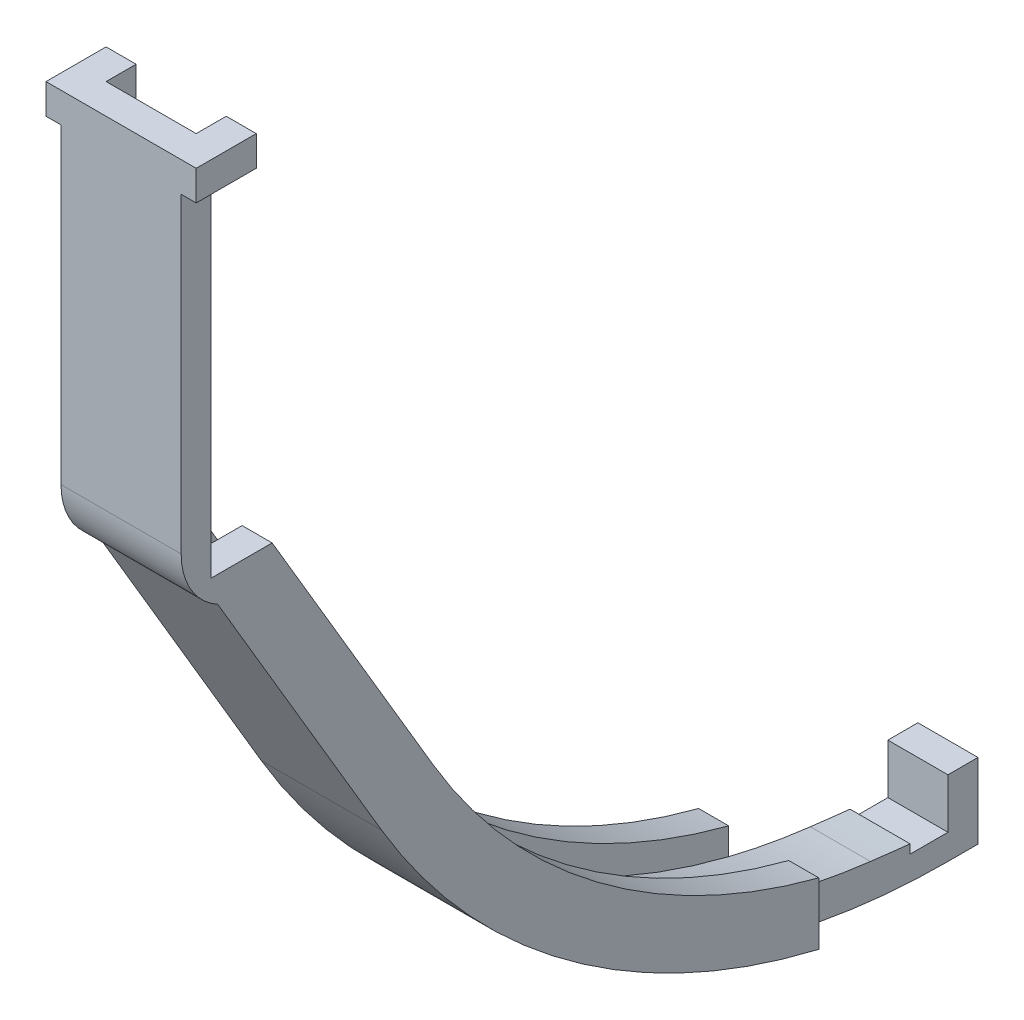
ISO-10303-21;
HEADER;
FILE_DESCRIPTION(('STEP AP214'),'2;1');
FILE_NAME('part.step','',(''),(''),'','','');
FILE_SCHEMA(('AUTOMOTIVE_DESIGN { 1 0 10303 214 1 1 1 1 }'));
ENDSEC;
DATA;
#1=APPLICATION_CONTEXT('core data for automotive mechanical design processes');
#2=APPLICATION_PROTOCOL_DEFINITION('international standard','automotive_design',2000,#1);
#3=PRODUCT_CONTEXT('',#1,'mechanical');
#4=PRODUCT('Part','Part','',(#3));
#5=PRODUCT_RELATED_PRODUCT_CATEGORY('part','',(#4));
#6=PRODUCT_DEFINITION_FORMATION('','',#4);
#7=PRODUCT_DEFINITION_CONTEXT('part definition',#1,'design');
#8=PRODUCT_DEFINITION('design','',#6,#7);
#9=PRODUCT_DEFINITION_SHAPE('','',#8);
#10=(LENGTH_UNIT() NAMED_UNIT(*) SI_UNIT(.MILLI.,.METRE.));
#11=(NAMED_UNIT(*) PLANE_ANGLE_UNIT() SI_UNIT($,.RADIAN.));
#12=(NAMED_UNIT(*) SI_UNIT($,.STERADIAN.) SOLID_ANGLE_UNIT());
#13=UNCERTAINTY_MEASURE_WITH_UNIT(LENGTH_MEASURE(1.E-05),#10,'distance_accuracy_value','');
#14=(GEOMETRIC_REPRESENTATION_CONTEXT(3) GLOBAL_UNCERTAINTY_ASSIGNED_CONTEXT((#13)) GLOBAL_UNIT_ASSIGNED_CONTEXT((#10,
#11,#12)) REPRESENTATION_CONTEXT('',''));
#15=CARTESIAN_POINT('',(0.,0.,0.));
#16=DIRECTION('',(0.,0.,1.));
#17=DIRECTION('',(1.,0.,0.));
#18=AXIS2_PLACEMENT_3D('',#15,#16,#17);
#19=CARTESIAN_POINT('',(-6.35,0.,0.));
#20=DIRECTION('',(1.,0.,0.));
#21=DIRECTION('',(0.,0.,-1.));
#22=AXIS2_PLACEMENT_3D('',#19,#20,#21);
#23=PLANE('',#22);
#24=DIRECTION('',(0.,1.,0.));
#25=VECTOR('',#24,1.);
#26=CARTESIAN_POINT('',(-6.35,-70.6177629374041,-57.785));
#27=LINE('',#26,#25);
#28=CARTESIAN_POINT('',(-6.35,-105.990711991471,-57.785));
#29=VERTEX_POINT('',#28);
#30=CARTESIAN_POINT('',(-6.35,-99.4487584920311,-57.785));
#31=VERTEX_POINT('',#30);
#32=EDGE_CURVE('E352',#29,#31,#27,.T.);
#33=ORIENTED_EDGE('',*,*,#32,.F.);
#34=CARTESIAN_POINT('',(-6.35,-34.7296686216215,-74.61));
#35=DIRECTION('',(1.,0.,0.));
#36=DIRECTION('',(0.,0.,-1.));
#37=AXIS2_PLACEMENT_3D('',#34,#35,#36);
#38=CIRCLE('',#37,73.2203313783785);
#39=CARTESIAN_POINT('',(-6.35,-71.962270862946,-11.5627934203356));
#40=VERTEX_POINT('',#39);
#41=EDGE_CURVE('E362',#40,#29,#38,.T.);
#42=ORIENTED_EDGE('',*,*,#41,.F.);
#43=DIRECTION('',(0.,0.861061475587392,0.508500870460675));
#44=VECTOR('',#43,1.);
#45=CARTESIAN_POINT('',(-6.35,-13.5447350029508,22.9357513144768));
#46=LINE('',#45,#44);
#47=CARTESIAN_POINT('',(-6.35,-42.6344563738377,5.75678203302841));
#48=VERTEX_POINT('',#47);
#49=EDGE_CURVE('E380',#40,#48,#46,.T.);
#50=ORIENTED_EDGE('',*,*,#49,.T.);
#51=CARTESIAN_POINT('',(-6.35,-36.1011936903704,2.15439927751977));
#52=DIRECTION('',(-1.,0.,0.));
#53=DIRECTION('',(0.,0.,-1.));
#54=AXIS2_PLACEMENT_3D('',#51,#52,#53);
#55=CIRCLE('',#54,7.46060874248023);
#56=CARTESIAN_POINT('',(-6.35,-36.1011936903704,9.61500801999999));
#57=VERTEX_POINT('',#56);
#58=EDGE_CURVE('E483',#48,#57,#55,.T.);
#59=ORIENTED_EDGE('',*,*,#58,.T.);
#60=DIRECTION('',(0.,1.,0.));
#61=VECTOR('',#60,1.);
#62=CARTESIAN_POINT('',(-6.35,0.,9.61500802));
#63=LINE('',#62,#61);
#64=CARTESIAN_POINT('',(-6.34999999999999,-3.17499999999999,9.61500801999999));
#65=VERTEX_POINT('',#64);
#66=EDGE_CURVE('E484',#57,#65,#63,.T.);
#67=ORIENTED_EDGE('',*,*,#66,.T.);
#68=DIRECTION('',(0.,0.,1.));
#69=VECTOR('',#68,1.);
#70=CARTESIAN_POINT('',(-6.35,-3.17499999999999,0.));
#71=LINE('',#70,#69);
#72=CARTESIAN_POINT('',(-6.34999999999999,-3.17499999999999,6.44000802));
#73=VERTEX_POINT('',#72);
#74=EDGE_CURVE('E479',#73,#65,#71,.T.);
#75=ORIENTED_EDGE('',*,*,#74,.F.);
#76=DIRECTION('',(0.,-1.,0.));
#77=VECTOR('',#76,1.);
#78=CARTESIAN_POINT('',(-6.35,-39.8949197300881,6.44000802));
#79=LINE('',#78,#77);
#80=CARTESIAN_POINT('',(-6.35,-39.8949197300881,6.44000802));
#81=VERTEX_POINT('',#80);
#82=EDGE_CURVE('E481',#73,#81,#79,.T.);
#83=ORIENTED_EDGE('',*,*,#82,.T.);
#84=DIRECTION('',(0.,0.,-1.));
#85=VECTOR('',#84,1.);
#86=CARTESIAN_POINT('',(-6.35,-39.8949197300881,-6.4400080213912));
#87=LINE('',#86,#85);
#88=CARTESIAN_POINT('',(-6.35,-39.8949197300881,0.));
#89=VERTEX_POINT('',#88);
#90=EDGE_CURVE('E332',#81,#89,#87,.T.);
#91=ORIENTED_EDGE('',*,*,#90,.T.);
#92=DIRECTION('',(0.,0.861061475587392,0.508500870460675));
#93=VECTOR('',#92,1.);
#94=CARTESIAN_POINT('',(-6.35,-10.3157544755255,17.4680109444969));
#95=LINE('',#94,#93);
#96=CARTESIAN_POINT('',(-6.35,-68.7332903355207,-17.0305337903155));
#97=VERTEX_POINT('',#96);
#98=EDGE_CURVE('E381',#97,#89,#95,.T.);
#99=ORIENTED_EDGE('',*,*,#98,.F.);
#100=CARTESIAN_POINT('',(-6.35,-34.7296686216215,-74.61));
#101=DIRECTION('',(1.,0.,0.));
#102=DIRECTION('',(0.,0.,-1.));
#103=AXIS2_PLACEMENT_3D('',#100,#101,#102);
#104=CIRCLE('',#103,66.8703313783785);
#105=EDGE_CURVE('E365',#97,#31,#104,.T.);
#106=ORIENTED_EDGE('',*,*,#105,.T.);
#107=EDGE_LOOP('',(#33,#42,#50,#59,#67,#75,#83,#91,#99,#106));
#108=FACE_BOUND('',#107,.T.);
#109=ADVANCED_FACE('F77',(#108),#23,.F.);
#110=CARTESIAN_POINT('',(6.35,-34.7296686216215,-74.61));
#111=DIRECTION('',(-1.,0.,0.));
#112=DIRECTION('',(0.,0.,1.));
#113=AXIS2_PLACEMENT_3D('',#110,#111,#112);
#114=CYLINDRICAL_SURFACE('',#113,66.8703313783785);
#115=CARTESIAN_POINT('',(6.35,-34.7296686216215,-74.61));
#116=DIRECTION('',(1.,0.,0.));
#117=DIRECTION('',(0.,0.,-1.));
#118=AXIS2_PLACEMENT_3D('',#115,#116,#117);
#119=CIRCLE('',#118,66.8703313783785);
#120=CARTESIAN_POINT('',(6.35,-68.7332903355207,-17.0305337903155));
#121=VERTEX_POINT('',#120);
#122=CARTESIAN_POINT('',(6.35,-99.4487584920311,-57.785));
#123=VERTEX_POINT('',#122);
#124=EDGE_CURVE('E372',#121,#123,#119,.T.);
#125=ORIENTED_EDGE('',*,*,#124,.T.);
#126=DIRECTION('',(-1.,0.,0.));
#127=VECTOR('',#126,1.);
#128=CARTESIAN_POINT('',(6.35,-99.4487584920311,-57.785));
#129=LINE('',#128,#127);
#130=CARTESIAN_POINT('',(3.175,-99.4487584920311,-57.785));
#131=VERTEX_POINT('',#130);
#132=EDGE_CURVE('E406',#123,#131,#129,.T.);
#133=ORIENTED_EDGE('',*,*,#132,.T.);
#134=CARTESIAN_POINT('',(3.175,-34.7296686216215,-74.61));
#135=DIRECTION('',(-1.,0.,0.));
#136=DIRECTION('',(0.,0.,1.));
#137=AXIS2_PLACEMENT_3D('',#134,#135,#136);
#138=CIRCLE('',#137,66.8703313783785);
#139=CARTESIAN_POINT('',(3.175,-68.7332903355207,-17.0305337903155));
#140=VERTEX_POINT('',#139);
#141=EDGE_CURVE('E530',#131,#140,#138,.T.);
#142=ORIENTED_EDGE('',*,*,#141,.T.);
#143=DIRECTION('',(-1.,0.,0.));
#144=VECTOR('',#143,1.);
#145=CARTESIAN_POINT('',(6.35,-68.7332903355207,-17.0305337903155));
#146=LINE('',#145,#144);
#147=EDGE_CURVE('E326',#121,#140,#146,.T.);
#148=ORIENTED_EDGE('',*,*,#147,.F.);
#149=EDGE_LOOP('',(#125,#133,#142,#148));
#150=FACE_BOUND('',#149,.T.);
#151=ADVANCED_FACE('F79',(#150),#114,.F.);
#152=CARTESIAN_POINT('',(-3.175,-34.7296686216215,-74.61));
#153=DIRECTION('',(1.,0.,0.));
#154=DIRECTION('',(0.,0.,-1.));
#155=AXIS2_PLACEMENT_3D('',#152,#153,#154);
#156=CIRCLE('',#155,66.8703313783785);
#157=CARTESIAN_POINT('',(-3.175,-68.7332903355207,-17.0305337903155));
#158=VERTEX_POINT('',#157);
#159=CARTESIAN_POINT('',(-3.175,-99.4487584920311,-57.785));
#160=VERTEX_POINT('',#159);
#161=EDGE_CURVE('E404',#158,#160,#156,.T.);
#162=ORIENTED_EDGE('',*,*,#161,.T.);
#163=DIRECTION('',(-1.,0.,0.));
#164=VECTOR('',#163,1.);
#165=CARTESIAN_POINT('',(6.35,-99.4487584920311,-57.785));
#166=LINE('',#165,#164);
#167=EDGE_CURVE('E403',#160,#31,#166,.T.);
#168=ORIENTED_EDGE('',*,*,#167,.T.);
#169=ORIENTED_EDGE('',*,*,#105,.F.);
#170=EDGE_CURVE('E329',#158,#97,#146,.T.);
#171=ORIENTED_EDGE('',*,*,#170,.F.);
#172=EDGE_LOOP('',(#162,#168,#169,#171));
#173=FACE_BOUND('',#172,.T.);
#174=ADVANCED_FACE('F402',(#173),#114,.F.);
#175=CARTESIAN_POINT('',(6.35,0.,0.));
#176=DIRECTION('',(1.,0.,0.));
#177=DIRECTION('',(0.,0.,-1.));
#178=AXIS2_PLACEMENT_3D('',#175,#176,#177);
#179=PLANE('',#178);
#180=CARTESIAN_POINT('',(6.35,-34.7296686216215,-74.61));
#181=DIRECTION('',(1.,0.,0.));
#182=DIRECTION('',(0.,0.,-1.));
#183=AXIS2_PLACEMENT_3D('',#180,#181,#182);
#184=CIRCLE('',#183,73.2203313783785);
#185=CARTESIAN_POINT('',(6.35,-71.962270862946,-11.5627934203356));
#186=VERTEX_POINT('',#185);
#187=CARTESIAN_POINT('',(6.35,-105.990711991471,-57.785));
#188=VERTEX_POINT('',#187);
#189=EDGE_CURVE('E375',#186,#188,#184,.T.);
#190=ORIENTED_EDGE('',*,*,#189,.T.);
#191=DIRECTION('',(0.,-1.,0.));
#192=VECTOR('',#191,1.);
#193=CARTESIAN_POINT('',(6.35,-70.6177629374041,-57.785));
#194=LINE('',#193,#192);
#195=EDGE_CURVE('E311',#123,#188,#194,.T.);
#196=ORIENTED_EDGE('',*,*,#195,.F.);
#197=ORIENTED_EDGE('',*,*,#124,.F.);
#198=DIRECTION('',(0.,0.861061475587392,0.508500870460675));
#199=VECTOR('',#198,1.);
#200=CARTESIAN_POINT('',(6.35,-10.3157544755255,17.4680109444969));
#201=LINE('',#200,#199);
#202=CARTESIAN_POINT('',(6.35,-39.8949197300881,0.));
#203=VERTEX_POINT('',#202);
#204=EDGE_CURVE('E333',#121,#203,#201,.T.);
#205=ORIENTED_EDGE('',*,*,#204,.T.);
#206=DIRECTION('',(0.,0.,-1.));
#207=VECTOR('',#206,1.);
#208=CARTESIAN_POINT('',(6.35,-39.8949197300881,-6.4400080213912));
#209=LINE('',#208,#207);
#210=CARTESIAN_POINT('',(6.35,-39.8949197300881,6.44000802));
#211=VERTEX_POINT('',#210);
#212=EDGE_CURVE('E330',#211,#203,#209,.T.);
#213=ORIENTED_EDGE('',*,*,#212,.F.);
#214=DIRECTION('',(0.,-1.,0.));
#215=VECTOR('',#214,1.);
#216=CARTESIAN_POINT('',(6.35,-39.8949197300881,6.44000802));
#217=LINE('',#216,#215);
#218=CARTESIAN_POINT('',(6.35,-3.17499999999999,6.44000802));
#219=VERTEX_POINT('',#218);
#220=EDGE_CURVE('E489',#219,#211,#217,.T.);
#221=ORIENTED_EDGE('',*,*,#220,.F.);
#222=DIRECTION('',(0.,0.,-1.));
#223=VECTOR('',#222,1.);
#224=CARTESIAN_POINT('',(6.35,-3.17499999999999,0.));
#225=LINE('',#224,#223);
#226=CARTESIAN_POINT('',(6.35,-3.17499999999999,9.61500801999999));
#227=VERTEX_POINT('',#226);
#228=EDGE_CURVE('E444',#227,#219,#225,.T.);
#229=ORIENTED_EDGE('',*,*,#228,.F.);
#230=DIRECTION('',(0.,1.,0.));
#231=VECTOR('',#230,1.);
#232=CARTESIAN_POINT('',(6.35,0.,9.61500802));
#233=LINE('',#232,#231);
#234=CARTESIAN_POINT('',(6.35,-36.1011936903704,9.61500802));
#235=VERTEX_POINT('',#234);
#236=EDGE_CURVE('E493',#235,#227,#233,.T.);
#237=ORIENTED_EDGE('',*,*,#236,.F.);
#238=CARTESIAN_POINT('',(6.35,-36.1011936903704,2.15439927751977));
#239=DIRECTION('',(1.,0.,0.));
#240=DIRECTION('',(0.,0.,-1.));
#241=AXIS2_PLACEMENT_3D('',#238,#239,#240);
#242=CIRCLE('',#241,7.46060874248023);
#243=CARTESIAN_POINT('',(6.35,-42.6344563738377,5.75678203302841));
#244=VERTEX_POINT('',#243);
#245=EDGE_CURVE('E498',#244,#235,#242,.F.);
#246=ORIENTED_EDGE('',*,*,#245,.F.);
#247=DIRECTION('',(0.,0.861061475587392,0.508500870460675));
#248=VECTOR('',#247,1.);
#249=CARTESIAN_POINT('',(6.35,-13.5447350029508,22.9357513144768));
#250=LINE('',#249,#248);
#251=EDGE_CURVE('E386',#186,#244,#250,.T.);
#252=ORIENTED_EDGE('',*,*,#251,.F.);
#253=EDGE_LOOP('',(#190,#196,#197,#205,#213,#221,#229,#237,#246,#252));
#254=FACE_BOUND('',#253,.T.);
#255=ADVANCED_FACE('F553',(#254),#179,.T.);
#256=CARTESIAN_POINT('',(-3.175,-34.7296686216215,-74.61));
#257=DIRECTION('',(1.,0.,0.));
#258=DIRECTION('',(0.,0.,-1.));
#259=AXIS2_PLACEMENT_3D('',#256,#257,#258);
#260=PLANE('',#259);
#261=CARTESIAN_POINT('',(-3.175,-34.7296686216215,-74.61));
#262=DIRECTION('',(1.,0.,0.));
#263=DIRECTION('',(0.,0.,-1.));
#264=AXIS2_PLACEMENT_3D('',#261,#262,#263);
#265=CIRCLE('',#264,69.6042015633686);
#266=CARTESIAN_POINT('',(-3.175,-70.1234657043146,-14.6765034947637));
#267=VERTEX_POINT('',#266);
#268=CARTESIAN_POINT('',(-3.175,-102.269762271794,-57.785));
#269=VERTEX_POINT('',#268);
#270=EDGE_CURVE('E542',#267,#269,#265,.T.);
#271=ORIENTED_EDGE('',*,*,#270,.T.);
#272=DIRECTION('',(0.,-1.,0.));
#273=VECTOR('',#272,1.);
#274=CARTESIAN_POINT('',(-3.175,-70.6177629374041,-57.785));
#275=LINE('',#274,#273);
#276=EDGE_CURVE('E366',#160,#269,#275,.T.);
#277=ORIENTED_EDGE('',*,*,#276,.F.);
#278=ORIENTED_EDGE('',*,*,#161,.F.);
#279=DIRECTION('',(0.,0.861061475587392,0.508500870460675));
#280=VECTOR('',#279,1.);
#281=CARTESIAN_POINT('',(-3.175,-68.7332903355207,-17.0305337903155));
#282=LINE('',#281,#280);
#283=CARTESIAN_POINT('',(-3.175,-39.8949197300881,0.));
#284=VERTEX_POINT('',#283);
#285=EDGE_CURVE('E398',#158,#284,#282,.T.);
#286=ORIENTED_EDGE('',*,*,#285,.T.);
#287=DIRECTION('',(0.,0.,-1.));
#288=VECTOR('',#287,1.);
#289=CARTESIAN_POINT('',(-3.175,-39.8949197300882,-74.61));
#290=LINE('',#289,#288);
#291=CARTESIAN_POINT('',(-3.175,-39.8949197300881,3.17500000000001));
#292=VERTEX_POINT('',#291);
#293=EDGE_CURVE('E510',#292,#284,#290,.T.);
#294=ORIENTED_EDGE('',*,*,#293,.F.);
#295=DIRECTION('',(0.,0.861061475587391,0.508500870460675));
#296=VECTOR('',#295,1.);
#297=CARTESIAN_POINT('',(-3.175,-39.8949197300881,3.175));
#298=LINE('',#297,#296);
#299=EDGE_CURVE('E535',#267,#292,#298,.T.);
#300=ORIENTED_EDGE('',*,*,#299,.F.);
#301=EDGE_LOOP('',(#271,#277,#278,#286,#294,#300));
#302=FACE_BOUND('',#301,.T.);
#303=ADVANCED_FACE('F577',(#302),#260,.T.);
#304=CARTESIAN_POINT('',(3.175,-34.7296686216215,-74.61));
#305=DIRECTION('',(-1.,0.,0.));
#306=DIRECTION('',(0.,0.,-1.));
#307=AXIS2_PLACEMENT_3D('',#304,#305,#306);
#308=PLANE('',#307);
#309=ORIENTED_EDGE('',*,*,#141,.F.);
#310=DIRECTION('',(0.,1.,0.));
#311=VECTOR('',#310,1.);
#312=CARTESIAN_POINT('',(3.175,-70.6177629374041,-57.785));
#313=LINE('',#312,#311);
#314=CARTESIAN_POINT('',(3.175,-102.269762271794,-57.785));
#315=VERTEX_POINT('',#314);
#316=EDGE_CURVE('E695',#315,#131,#313,.T.);
#317=ORIENTED_EDGE('',*,*,#316,.F.);
#318=CARTESIAN_POINT('',(3.175,-34.7296686216215,-74.61));
#319=DIRECTION('',(1.,0.,0.));
#320=DIRECTION('',(0.,0.,-1.));
#321=AXIS2_PLACEMENT_3D('',#318,#319,#320);
#322=CIRCLE('',#321,69.6042015633686);
#323=CARTESIAN_POINT('',(3.175,-70.1234657043146,-14.6765034947637));
#324=VERTEX_POINT('',#323);
#325=EDGE_CURVE('E524',#324,#315,#322,.T.);
#326=ORIENTED_EDGE('',*,*,#325,.F.);
#327=DIRECTION('',(0.,0.861061475587391,0.508500870460675));
#328=VECTOR('',#327,1.);
#329=CARTESIAN_POINT('',(3.175,-39.8949197300881,3.175));
#330=LINE('',#329,#328);
#331=CARTESIAN_POINT('',(3.175,-39.8949197300881,3.175));
#332=VERTEX_POINT('',#331);
#333=EDGE_CURVE('E521',#324,#332,#330,.T.);
#334=ORIENTED_EDGE('',*,*,#333,.T.);
#335=DIRECTION('',(0.,0.,1.));
#336=VECTOR('',#335,1.);
#337=CARTESIAN_POINT('',(3.175,-39.8949197300882,-74.61));
#338=LINE('',#337,#336);
#339=CARTESIAN_POINT('',(3.175,-39.8949197300881,0.));
#340=VERTEX_POINT('',#339);
#341=EDGE_CURVE('E508',#340,#332,#338,.T.);
#342=ORIENTED_EDGE('',*,*,#341,.F.);
#343=DIRECTION('',(0.,0.861061475587392,0.508500870460675));
#344=VECTOR('',#343,1.);
#345=CARTESIAN_POINT('',(3.175,-68.7332903355207,-17.0305337903155));
#346=LINE('',#345,#344);
#347=EDGE_CURVE('E532',#140,#340,#346,.T.);
#348=ORIENTED_EDGE('',*,*,#347,.F.);
#349=EDGE_LOOP('',(#309,#317,#326,#334,#342,#348));
#350=FACE_BOUND('',#349,.T.);
#351=ADVANCED_FACE('F566',(#350),#308,.T.);
#352=CARTESIAN_POINT('',(49.1586764343306,-39.8949197300881,6.44000802));
#353=DIRECTION('',(0.,0.,-1.));
#354=DIRECTION('',(0.,1.,0.));
#355=AXIS2_PLACEMENT_3D('',#352,#353,#354);
#356=PLANE('',#355);
#357=DIRECTION('',(-1.,0.,0.));
#358=VECTOR('',#357,1.);
#359=CARTESIAN_POINT('',(49.1586764343305,-3.17499999999993,6.44000802));
#360=LINE('',#359,#358);
#361=CARTESIAN_POINT('',(4.7625,-3.17499999999999,6.44000802));
#362=VERTEX_POINT('',#361);
#363=EDGE_CURVE('E446',#219,#362,#360,.T.);
#364=ORIENTED_EDGE('',*,*,#363,.F.);
#365=ORIENTED_EDGE('',*,*,#220,.T.);
#366=DIRECTION('',(-1.,0.,0.));
#367=VECTOR('',#366,1.);
#368=CARTESIAN_POINT('',(40.64,-39.8949197300881,6.44000802));
#369=LINE('',#368,#367);
#370=EDGE_CURVE('E491',#211,#81,#369,.T.);
#371=ORIENTED_EDGE('',*,*,#370,.T.);
#372=ORIENTED_EDGE('',*,*,#82,.F.);
#373=DIRECTION('',(1.,0.,0.));
#374=VECTOR('',#373,1.);
#375=CARTESIAN_POINT('',(49.1586764343306,-3.17500000000007,6.44000802));
#376=LINE('',#375,#374);
#377=CARTESIAN_POINT('',(-4.7625,-3.17499999999999,6.44000802));
#378=VERTEX_POINT('',#377);
#379=EDGE_CURVE('E476',#73,#378,#376,.T.);
#380=ORIENTED_EDGE('',*,*,#379,.T.);
#381=DIRECTION('',(0.,1.,0.));
#382=VECTOR('',#381,1.);
#383=CARTESIAN_POINT('',(-4.76250000000005,-39.894919730088,6.44000802));
#384=LINE('',#383,#382);
#385=CARTESIAN_POINT('',(-4.7625,0.,6.44000802));
#386=VERTEX_POINT('',#385);
#387=EDGE_CURVE('E473',#378,#386,#384,.T.);
#388=ORIENTED_EDGE('',*,*,#387,.T.);
#389=DIRECTION('',(-1.,0.,0.));
#390=VECTOR('',#389,1.);
#391=CARTESIAN_POINT('',(49.1586764343306,0.,6.44000802));
#392=LINE('',#391,#390);
#393=CARTESIAN_POINT('',(4.7625,0.,6.44000802));
#394=VERTEX_POINT('',#393);
#395=EDGE_CURVE('E492',#394,#386,#392,.T.);
#396=ORIENTED_EDGE('',*,*,#395,.F.);
#397=DIRECTION('',(0.,-1.,0.));
#398=VECTOR('',#397,1.);
#399=CARTESIAN_POINT('',(4.76250000000005,-39.8949197300881,6.44000802));
#400=LINE('',#399,#398);
#401=EDGE_CURVE('E441',#394,#362,#400,.T.);
#402=ORIENTED_EDGE('',*,*,#401,.T.);
#403=EDGE_LOOP('',(#364,#365,#371,#372,#380,#388,#396,#402));
#404=FACE_BOUND('',#403,.T.);
#405=ADVANCED_FACE('F581',(#404),#356,.T.);
#406=CARTESIAN_POINT('',(-3.175,628.104447988835,-153.204666657603));
#407=DIRECTION('',(1.,0.,0.));
#408=DIRECTION('',(0.,0.,-1.));
#409=AXIS2_PLACEMENT_3D('',#406,#407,#408);
#410=CYLINDRICAL_SURFACE('',#409,737.081682659011);
#411=DIRECTION('',(1.,0.,0.));
#412=VECTOR('',#411,1.);
#413=CARTESIAN_POINT('',(-3.175,-104.334988381954,-70.6099999999999));
#414=LINE('',#413,#412);
#415=CARTESIAN_POINT('',(-3.175,-104.334988381954,-70.61));
#416=VERTEX_POINT('',#415);
#417=CARTESIAN_POINT('',(3.175,-104.334988381954,-70.61));
#418=VERTEX_POINT('',#417);
#419=EDGE_CURVE('E516',#416,#418,#414,.T.);
#420=ORIENTED_EDGE('',*,*,#419,.F.);
#421=CARTESIAN_POINT('',(-3.175,628.104447988835,-153.204666657603));
#422=DIRECTION('',(1.,0.,0.));
#423=DIRECTION('',(0.,0.,-1.));
#424=AXIS2_PLACEMENT_3D('',#421,#422,#423);
#425=CIRCLE('',#424,737.081682659011);
#426=CARTESIAN_POINT('',(-3.175,-103.84966257243,-66.4141893924842));
#427=VERTEX_POINT('',#426);
#428=EDGE_CURVE('E540',#427,#416,#425,.T.);
#429=ORIENTED_EDGE('',*,*,#428,.F.);
#430=DIRECTION('',(1.,0.,0.));
#431=VECTOR('',#430,1.);
#432=CARTESIAN_POINT('',(-3.175,-103.84966257243,-66.4141893924842));
#433=LINE('',#432,#431);
#434=CARTESIAN_POINT('',(3.175,-103.84966257243,-66.4141893924843));
#435=VERTEX_POINT('',#434);
#436=EDGE_CURVE('E377',#427,#435,#433,.T.);
#437=ORIENTED_EDGE('',*,*,#436,.T.);
#438=CARTESIAN_POINT('',(3.175,628.104447988835,-153.204666657603));
#439=DIRECTION('',(1.,0.,0.));
#440=DIRECTION('',(0.,0.,-1.));
#441=AXIS2_PLACEMENT_3D('',#438,#439,#440);
#442=CIRCLE('',#441,737.081682659011);
#443=EDGE_CURVE('E527',#435,#418,#442,.T.);
#444=ORIENTED_EDGE('',*,*,#443,.T.);
#445=EDGE_LOOP('',(#420,#429,#437,#444));
#446=FACE_BOUND('',#445,.T.);
#447=ADVANCED_FACE('F616',(#446),#410,.F.);
#448=CARTESIAN_POINT('',(6.35,-10.3157544755255,17.4680109444969));
#449=DIRECTION('',(0.,-0.508500870460675,0.861061475587391));
#450=DIRECTION('',(0.,-0.861061475587392,-0.508500870460675));
#451=AXIS2_PLACEMENT_3D('',#448,#449,#450);
#452=PLANE('',#451);
#453=ORIENTED_EDGE('',*,*,#347,.T.);
#454=DIRECTION('',(1.,0.,0.));
#455=VECTOR('',#454,1.);
#456=CARTESIAN_POINT('',(-7.62,-39.8949197300881,0.));
#457=LINE('',#456,#455);
#458=EDGE_CURVE('E339',#340,#203,#457,.T.);
#459=ORIENTED_EDGE('',*,*,#458,.T.);
#460=ORIENTED_EDGE('',*,*,#204,.F.);
#461=ORIENTED_EDGE('',*,*,#147,.T.);
#462=EDGE_LOOP('',(#453,#459,#460,#461));
#463=FACE_BOUND('',#462,.T.);
#464=ADVANCED_FACE('F559',(#463),#452,.F.);
#465=ORIENTED_EDGE('',*,*,#285,.F.);
#466=ORIENTED_EDGE('',*,*,#170,.T.);
#467=ORIENTED_EDGE('',*,*,#98,.T.);
#468=EDGE_CURVE('E336',#89,#284,#457,.T.);
#469=ORIENTED_EDGE('',*,*,#468,.T.);
#470=EDGE_LOOP('',(#465,#466,#467,#469));
#471=FACE_BOUND('',#470,.T.);
#472=ADVANCED_FACE('F396',(#471),#452,.F.);
#473=CARTESIAN_POINT('',(6.35,-13.5447350029508,22.9357513144768));
#474=DIRECTION('',(0.,-0.508500870460675,0.861061475587391));
#475=DIRECTION('',(0.,-0.861061475587392,-0.508500870460675));
#476=AXIS2_PLACEMENT_3D('',#473,#474,#475);
#477=PLANE('',#476);
#478=DIRECTION('',(-1.,0.,0.));
#479=VECTOR('',#478,1.);
#480=CARTESIAN_POINT('',(49.1586764343306,-42.6344563738377,5.75678203302842));
#481=LINE('',#480,#479);
#482=EDGE_CURVE('E487',#244,#48,#481,.T.);
#483=ORIENTED_EDGE('',*,*,#482,.T.);
#484=ORIENTED_EDGE('',*,*,#49,.F.);
#485=DIRECTION('',(-1.,0.,0.));
#486=VECTOR('',#485,1.);
#487=CARTESIAN_POINT('',(6.35,-71.962270862946,-11.5627934203356));
#488=LINE('',#487,#486);
#489=EDGE_CURVE('E318',#186,#40,#488,.T.);
#490=ORIENTED_EDGE('',*,*,#489,.F.);
#491=ORIENTED_EDGE('',*,*,#251,.T.);
#492=EDGE_LOOP('',(#483,#484,#490,#491));
#493=FACE_BOUND('',#492,.T.);
#494=ADVANCED_FACE('F592',(#493),#477,.T.);
#495=CARTESIAN_POINT('',(6.35,-101.6,-74.61));
#496=DIRECTION('',(0.,0.,1.));
#497=DIRECTION('',(1.,0.,0.));
#498=AXIS2_PLACEMENT_3D('',#495,#496,#497);
#499=PLANE('',#498);
#500=DIRECTION('',(0.,-1.,0.));
#501=VECTOR('',#500,1.);
#502=CARTESIAN_POINT('',(3.175,-101.6,-74.61));
#503=LINE('',#502,#501);
#504=CARTESIAN_POINT('',(3.175,-100.0125,-74.61));
#505=VERTEX_POINT('',#504);
#506=CARTESIAN_POINT('',(3.175,-105.275,-74.61));
#507=VERTEX_POINT('',#506);
#508=EDGE_CURVE('E100',#505,#507,#503,.T.);
#509=ORIENTED_EDGE('',*,*,#508,.F.);
#510=DIRECTION('',(-1.,0.,0.));
#511=VECTOR('',#510,1.);
#512=CARTESIAN_POINT('',(6.35,-100.0125,-74.61));
#513=LINE('',#512,#511);
#514=CARTESIAN_POINT('',(-3.175,-100.0125,-74.61));
#515=VERTEX_POINT('',#514);
#516=EDGE_CURVE('E320',#505,#515,#513,.T.);
#517=ORIENTED_EDGE('',*,*,#516,.T.);
#518=DIRECTION('',(0.,1.,0.));
#519=VECTOR('',#518,1.);
#520=CARTESIAN_POINT('',(-3.175,-101.6,-74.61));
#521=LINE('',#520,#519);
#522=CARTESIAN_POINT('',(-3.175,-105.275,-74.61));
#523=VERTEX_POINT('',#522);
#524=EDGE_CURVE('E704',#523,#515,#521,.T.);
#525=ORIENTED_EDGE('',*,*,#524,.F.);
#526=DIRECTION('',(-1.,0.,0.));
#527=VECTOR('',#526,1.);
#528=CARTESIAN_POINT('',(29.999999944,-105.275,-74.61));
#529=LINE('',#528,#527);
#530=EDGE_CURVE('E512',#507,#523,#529,.T.);
#531=ORIENTED_EDGE('',*,*,#530,.F.);
#532=EDGE_LOOP('',(#509,#517,#525,#531));
#533=FACE_BOUND('',#532,.T.);
#534=ADVANCED_FACE('F594',(#533),#499,.T.);
#535=CARTESIAN_POINT('',(6.35,-100.0125,-74.61));
#536=DIRECTION('',(0.,1.,0.));
#537=DIRECTION('',(0.,0.,1.));
#538=AXIS2_PLACEMENT_3D('',#535,#536,#537);
#539=PLANE('',#538);
#540=DIRECTION('',(0.,0.,1.));
#541=VECTOR('',#540,1.);
#542=CARTESIAN_POINT('',(3.175,-100.0125,-74.61));
#543=LINE('',#542,#541);
#544=CARTESIAN_POINT('',(3.175,-100.0125,-77.785));
#545=VERTEX_POINT('',#544);
#546=EDGE_CURVE('E411',#545,#505,#543,.T.);
#547=ORIENTED_EDGE('',*,*,#546,.F.);
#548=DIRECTION('',(-1.,0.,0.));
#549=VECTOR('',#548,1.);
#550=CARTESIAN_POINT('',(6.35,-100.0125,-77.785));
#551=LINE('',#550,#549);
#552=CARTESIAN_POINT('',(-3.175,-100.0125,-77.785));
#553=VERTEX_POINT('',#552);
#554=EDGE_CURVE('E310',#545,#553,#551,.T.);
#555=ORIENTED_EDGE('',*,*,#554,.T.);
#556=DIRECTION('',(0.,0.,-1.));
#557=VECTOR('',#556,1.);
#558=CARTESIAN_POINT('',(-3.175,-100.0125,-74.61));
#559=LINE('',#558,#557);
#560=EDGE_CURVE('E706',#515,#553,#559,.T.);
#561=ORIENTED_EDGE('',*,*,#560,.F.);
#562=ORIENTED_EDGE('',*,*,#516,.F.);
#563=EDGE_LOOP('',(#547,#555,#561,#562));
#564=FACE_BOUND('',#563,.T.);
#565=ADVANCED_FACE('F601',(#564),#539,.T.);
#566=CARTESIAN_POINT('',(6.35,-100.0125,-77.785));
#567=DIRECTION('',(0.,0.,-1.));
#568=DIRECTION('',(-1.,0.,0.));
#569=AXIS2_PLACEMENT_3D('',#566,#567,#568);
#570=PLANE('',#569);
#571=DIRECTION('',(0.,1.,0.));
#572=VECTOR('',#571,1.);
#573=CARTESIAN_POINT('',(3.175,-70.6177629374041,-77.785));
#574=LINE('',#573,#572);
#575=CARTESIAN_POINT('',(3.175,-107.95,-77.785));
#576=VERTEX_POINT('',#575);
#577=EDGE_CURVE('E292',#576,#545,#574,.T.);
#578=ORIENTED_EDGE('',*,*,#577,.F.);
#579=DIRECTION('',(-1.,0.,0.));
#580=VECTOR('',#579,1.);
#581=CARTESIAN_POINT('',(6.35,-107.95,-77.785));
#582=LINE('',#581,#580);
#583=CARTESIAN_POINT('',(-3.175,-107.95,-77.785));
#584=VERTEX_POINT('',#583);
#585=EDGE_CURVE('E308',#576,#584,#582,.T.);
#586=ORIENTED_EDGE('',*,*,#585,.T.);
#587=DIRECTION('',(0.,-1.,0.));
#588=VECTOR('',#587,1.);
#589=CARTESIAN_POINT('',(-3.175,-70.6177629374041,-77.785));
#590=LINE('',#589,#588);
#591=EDGE_CURVE('E699',#553,#584,#590,.T.);
#592=ORIENTED_EDGE('',*,*,#591,.F.);
#593=ORIENTED_EDGE('',*,*,#554,.F.);
#594=EDGE_LOOP('',(#578,#586,#592,#593));
#595=FACE_BOUND('',#594,.T.);
#596=ADVANCED_FACE('F306',(#595),#570,.T.);
#597=CARTESIAN_POINT('',(6.35,-107.95,-74.61));
#598=DIRECTION('',(0.,1.,0.));
#599=DIRECTION('',(0.,0.,1.));
#600=AXIS2_PLACEMENT_3D('',#597,#598,#599);
#601=PLANE('',#600);
#602=ORIENTED_EDGE('',*,*,#585,.F.);
#603=DIRECTION('',(0.,0.,-1.));
#604=VECTOR('',#603,1.);
#605=CARTESIAN_POINT('',(3.175,-107.95,-57.785));
#606=LINE('',#605,#604);
#607=CARTESIAN_POINT('',(3.175,-107.95,-74.61));
#608=VERTEX_POINT('',#607);
#609=EDGE_CURVE('E289',#608,#576,#606,.T.);
#610=ORIENTED_EDGE('',*,*,#609,.F.);
#611=DIRECTION('',(-1.,0.,0.));
#612=VECTOR('',#611,1.);
#613=CARTESIAN_POINT('',(6.35,-107.95,-74.61));
#614=LINE('',#613,#612);
#615=CARTESIAN_POINT('',(-3.175,-107.95,-74.61));
#616=VERTEX_POINT('',#615);
#617=EDGE_CURVE('E316',#608,#616,#614,.T.);
#618=ORIENTED_EDGE('',*,*,#617,.T.);
#619=DIRECTION('',(0.,0.,-1.));
#620=VECTOR('',#619,1.);
#621=CARTESIAN_POINT('',(-3.175,-107.95,-57.785));
#622=LINE('',#621,#620);
#623=EDGE_CURVE('E312',#616,#584,#622,.T.);
#624=ORIENTED_EDGE('',*,*,#623,.T.);
#625=EDGE_LOOP('',(#602,#610,#618,#624));
#626=FACE_BOUND('',#625,.T.);
#627=ADVANCED_FACE('F315',(#626),#601,.F.);
#628=CARTESIAN_POINT('',(6.35,-34.7296686216215,-74.61));
#629=DIRECTION('',(-1.,0.,0.));
#630=DIRECTION('',(0.,0.,1.));
#631=AXIS2_PLACEMENT_3D('',#628,#629,#630);
#632=CYLINDRICAL_SURFACE('',#631,73.2203313783785);
#633=ORIENTED_EDGE('',*,*,#617,.F.);
#634=CARTESIAN_POINT('',(3.17500000000001,-34.7296686216215,-74.61));
#635=DIRECTION('',(-1.,0.,0.));
#636=DIRECTION('',(0.,-1.,0.));
#637=AXIS2_PLACEMENT_3D('',#634,#635,#636);
#638=CIRCLE('',#637,73.2203313783785);
#639=CARTESIAN_POINT('',(3.175,-105.990711991471,-57.785));
#640=VERTEX_POINT('',#639);
#641=EDGE_CURVE('E296',#608,#640,#638,.T.);
#642=ORIENTED_EDGE('',*,*,#641,.T.);
#643=DIRECTION('',(-1.,0.,0.));
#644=VECTOR('',#643,1.);
#645=CARTESIAN_POINT('',(6.35,-105.990711991471,-57.785));
#646=LINE('',#645,#644);
#647=EDGE_CURVE('E12',#188,#640,#646,.T.);
#648=ORIENTED_EDGE('',*,*,#647,.F.);
#649=ORIENTED_EDGE('',*,*,#189,.F.);
#650=ORIENTED_EDGE('',*,*,#489,.T.);
#651=ORIENTED_EDGE('',*,*,#41,.T.);
#652=DIRECTION('',(-1.,0.,0.));
#653=VECTOR('',#652,1.);
#654=CARTESIAN_POINT('',(6.35,-105.990711991471,-57.785));
#655=LINE('',#654,#653);
#656=CARTESIAN_POINT('',(-3.175,-105.990711991471,-57.785));
#657=VERTEX_POINT('',#656);
#658=EDGE_CURVE('E85',#657,#29,#655,.T.);
#659=ORIENTED_EDGE('',*,*,#658,.F.);
#660=CARTESIAN_POINT('',(-3.175,-34.7296686216215,-74.61));
#661=DIRECTION('',(1.,0.,0.));
#662=DIRECTION('',(0.,1.,0.));
#663=AXIS2_PLACEMENT_3D('',#660,#661,#662);
#664=CIRCLE('',#663,73.2203313783785);
#665=EDGE_CURVE('E711',#657,#616,#664,.T.);
#666=ORIENTED_EDGE('',*,*,#665,.T.);
#667=EDGE_LOOP('',(#633,#642,#648,#649,#650,#651,#659,#666));
#668=FACE_BOUND('',#667,.T.);
#669=ADVANCED_FACE('F369',(#668),#632,.T.);
#670=CARTESIAN_POINT('',(-3.175,-34.7296686216215,-74.61));
#671=DIRECTION('',(1.,0.,0.));
#672=DIRECTION('',(0.,0.,-1.));
#673=AXIS2_PLACEMENT_3D('',#670,#671,#672);
#674=CYLINDRICAL_SURFACE('',#673,69.6042015633686);
#675=DIRECTION('',(1.,0.,0.));
#676=VECTOR('',#675,1.);
#677=CARTESIAN_POINT('',(-3.175,-70.1234657043146,-14.6765034947637));
#678=LINE('',#677,#676);
#679=EDGE_CURVE('E545',#267,#324,#678,.T.);
#680=ORIENTED_EDGE('',*,*,#679,.T.);
#681=ORIENTED_EDGE('',*,*,#325,.T.);
#682=CARTESIAN_POINT('',(3.17500000000001,-34.7296686216215,-74.61));
#683=DIRECTION('',(-1.,0.,0.));
#684=DIRECTION('',(0.,-1.,0.));
#685=AXIS2_PLACEMENT_3D('',#682,#683,#684);
#686=CIRCLE('',#685,69.6042015633686);
#687=EDGE_CURVE('E716',#315,#435,#686,.F.);
#688=ORIENTED_EDGE('',*,*,#687,.T.);
#689=ORIENTED_EDGE('',*,*,#436,.F.);
#690=CARTESIAN_POINT('',(-3.175,-34.7296686216215,-74.61));
#691=DIRECTION('',(1.,0.,0.));
#692=DIRECTION('',(0.,1.,0.));
#693=AXIS2_PLACEMENT_3D('',#690,#691,#692);
#694=CIRCLE('',#693,69.6042015633686);
#695=EDGE_CURVE('E708',#427,#269,#694,.F.);
#696=ORIENTED_EDGE('',*,*,#695,.T.);
#697=ORIENTED_EDGE('',*,*,#270,.F.);
#698=EDGE_LOOP('',(#680,#681,#688,#689,#696,#697));
#699=FACE_BOUND('',#698,.T.);
#700=ADVANCED_FACE('F596',(#699),#674,.F.);
#701=CARTESIAN_POINT('',(-3.175,-39.8949197300881,3.175));
#702=DIRECTION('',(0.,-0.508500870460675,0.861061475587391));
#703=DIRECTION('',(0.,-0.861061475587391,-0.508500870460675));
#704=AXIS2_PLACEMENT_3D('',#701,#702,#703);
#705=PLANE('',#704);
#706=ORIENTED_EDGE('',*,*,#299,.T.);
#707=DIRECTION('',(1.,0.,0.));
#708=VECTOR('',#707,1.);
#709=CARTESIAN_POINT('',(-3.175,-39.8949197300881,3.17500000000001));
#710=LINE('',#709,#708);
#711=EDGE_CURVE('E340',#292,#332,#710,.T.);
#712=ORIENTED_EDGE('',*,*,#711,.T.);
#713=ORIENTED_EDGE('',*,*,#333,.F.);
#714=ORIENTED_EDGE('',*,*,#679,.F.);
#715=EDGE_LOOP('',(#706,#712,#713,#714));
#716=FACE_BOUND('',#715,.T.);
#717=ADVANCED_FACE('F573',(#716),#705,.F.);
#718=CARTESIAN_POINT('',(29.999999944,2.97416513330826E-13,-70.6099999999995));
#719=DIRECTION('',(0.,0.,-1.));
#720=DIRECTION('',(0.,1.,0.));
#721=AXIS2_PLACEMENT_3D('',#718,#719,#720);
#722=PLANE('',#721);
#723=DIRECTION('',(0.,1.,0.));
#724=VECTOR('',#723,1.);
#725=CARTESIAN_POINT('',(3.17500000000001,3.00532718038028E-13,-70.6099999999995));
#726=LINE('',#725,#724);
#727=CARTESIAN_POINT('',(3.175,-105.275,-70.61));
#728=VERTEX_POINT('',#727);
#729=EDGE_CURVE('E713',#728,#418,#726,.T.);
#730=ORIENTED_EDGE('',*,*,#729,.F.);
#731=DIRECTION('',(-1.,0.,0.));
#732=VECTOR('',#731,1.);
#733=CARTESIAN_POINT('',(29.999999944,-105.275,-70.61));
#734=LINE('',#733,#732);
#735=CARTESIAN_POINT('',(-3.175,-105.275,-70.61));
#736=VERTEX_POINT('',#735);
#737=EDGE_CURVE('E513',#728,#736,#734,.T.);
#738=ORIENTED_EDGE('',*,*,#737,.T.);
#739=DIRECTION('',(0.,-1.,0.));
#740=VECTOR('',#739,1.);
#741=CARTESIAN_POINT('',(-3.17499999999999,3.00884997285438E-13,-70.6099999999995));
#742=LINE('',#741,#740);
#743=EDGE_CURVE('E92',#416,#736,#742,.T.);
#744=ORIENTED_EDGE('',*,*,#743,.F.);
#745=ORIENTED_EDGE('',*,*,#419,.T.);
#746=EDGE_LOOP('',(#730,#738,#744,#745));
#747=FACE_BOUND('',#746,.T.);
#748=ADVANCED_FACE('F629',(#747),#722,.T.);
#749=CARTESIAN_POINT('',(29.999999944,-105.275,-3.65246027866914E-13));
#750=DIRECTION('',(0.,-1.,0.));
#751=DIRECTION('',(0.,0.,-1.));
#752=AXIS2_PLACEMENT_3D('',#749,#750,#751);
#753=PLANE('',#752);
#754=ORIENTED_EDGE('',*,*,#737,.F.);
#755=DIRECTION('',(0.,0.,-1.));
#756=VECTOR('',#755,1.);
#757=CARTESIAN_POINT('',(3.175,-105.275,-3.65246027866914E-13));
#758=LINE('',#757,#756);
#759=EDGE_CURVE('E345',#728,#507,#758,.T.);
#760=ORIENTED_EDGE('',*,*,#759,.T.);
#761=ORIENTED_EDGE('',*,*,#530,.T.);
#762=DIRECTION('',(0.,0.,1.));
#763=VECTOR('',#762,1.);
#764=CARTESIAN_POINT('',(-3.175,-105.275,-3.65246027866914E-13));
#765=LINE('',#764,#763);
#766=EDGE_CURVE('E343',#523,#736,#765,.T.);
#767=ORIENTED_EDGE('',*,*,#766,.T.);
#768=EDGE_LOOP('',(#754,#760,#761,#767));
#769=FACE_BOUND('',#768,.T.);
#770=ADVANCED_FACE('F636',(#769),#753,.F.);
#771=CARTESIAN_POINT('',(40.64,-39.8949197300881,-6.44000802139121));
#772=DIRECTION('',(0.,-1.,0.));
#773=DIRECTION('',(0.,0.,-1.));
#774=AXIS2_PLACEMENT_3D('',#771,#772,#773);
#775=PLANE('',#774);
#776=ORIENTED_EDGE('',*,*,#370,.F.);
#777=ORIENTED_EDGE('',*,*,#212,.T.);
#778=ORIENTED_EDGE('',*,*,#458,.F.);
#779=ORIENTED_EDGE('',*,*,#341,.T.);
#780=ORIENTED_EDGE('',*,*,#711,.F.);
#781=ORIENTED_EDGE('',*,*,#293,.T.);
#782=ORIENTED_EDGE('',*,*,#468,.F.);
#783=ORIENTED_EDGE('',*,*,#90,.F.);
#784=EDGE_LOOP('',(#776,#777,#778,#779,#780,#781,#782,#783));
#785=FACE_BOUND('',#784,.T.);
#786=ADVANCED_FACE('F570',(#785),#775,.F.);
#787=CARTESIAN_POINT('',(49.1586764343306,0.,6.44000802));
#788=DIRECTION('',(0.,1.,0.));
#789=DIRECTION('',(0.,0.,1.));
#790=AXIS2_PLACEMENT_3D('',#787,#788,#789);
#791=PLANE('',#790);
#792=DIRECTION('',(0.,0.,-1.));
#793=VECTOR('',#792,1.);
#794=CARTESIAN_POINT('',(4.7625,0.,9.61500801999999));
#795=LINE('',#794,#793);
#796=CARTESIAN_POINT('',(4.7625,0.,3.26500801999999));
#797=VERTEX_POINT('',#796);
#798=EDGE_CURVE('E419',#394,#797,#795,.T.);
#799=ORIENTED_EDGE('',*,*,#798,.F.);
#800=ORIENTED_EDGE('',*,*,#395,.T.);
#801=DIRECTION('',(0.,0.,-1.));
#802=VECTOR('',#801,1.);
#803=CARTESIAN_POINT('',(-4.7625,0.,9.61500801999999));
#804=LINE('',#803,#802);
#805=CARTESIAN_POINT('',(-4.7625,0.,3.26500801999999));
#806=VERTEX_POINT('',#805);
#807=EDGE_CURVE('E448',#386,#806,#804,.T.);
#808=ORIENTED_EDGE('',*,*,#807,.T.);
#809=DIRECTION('',(1.,0.,0.));
#810=VECTOR('',#809,1.);
#811=CARTESIAN_POINT('',(-7.9375,0.,3.26500801999999));
#812=LINE('',#811,#810);
#813=CARTESIAN_POINT('',(-7.9375,0.,3.26500801999999));
#814=VERTEX_POINT('',#813);
#815=EDGE_CURVE('E470',#814,#806,#812,.T.);
#816=ORIENTED_EDGE('',*,*,#815,.F.);
#817=DIRECTION('',(0.,0.,-1.));
#818=VECTOR('',#817,1.);
#819=CARTESIAN_POINT('',(-7.9375,0.,9.61500801999999));
#820=LINE('',#819,#818);
#821=CARTESIAN_POINT('',(-7.9375,0.,9.61500801999999));
#822=VERTEX_POINT('',#821);
#823=EDGE_CURVE('E452',#822,#814,#820,.T.);
#824=ORIENTED_EDGE('',*,*,#823,.F.);
#825=DIRECTION('',(-1.,0.,0.));
#826=VECTOR('',#825,1.);
#827=CARTESIAN_POINT('',(49.1586764343306,0.,9.61500802));
#828=LINE('',#827,#826);
#829=CARTESIAN_POINT('',(7.9375,0.,9.61500801999999));
#830=VERTEX_POINT('',#829);
#831=EDGE_CURVE('E496',#830,#822,#828,.T.);
#832=ORIENTED_EDGE('',*,*,#831,.F.);
#833=DIRECTION('',(0.,0.,-1.));
#834=VECTOR('',#833,1.);
#835=CARTESIAN_POINT('',(7.9375,0.,9.61500801999999));
#836=LINE('',#835,#834);
#837=CARTESIAN_POINT('',(7.9375,0.,3.26500801999999));
#838=VERTEX_POINT('',#837);
#839=EDGE_CURVE('E425',#830,#838,#836,.T.);
#840=ORIENTED_EDGE('',*,*,#839,.T.);
#841=DIRECTION('',(-1.,0.,0.));
#842=VECTOR('',#841,1.);
#843=CARTESIAN_POINT('',(7.9375,0.,3.26500801999999));
#844=LINE('',#843,#842);
#845=EDGE_CURVE('E428',#838,#797,#844,.T.);
#846=ORIENTED_EDGE('',*,*,#845,.T.);
#847=EDGE_LOOP('',(#799,#800,#808,#816,#824,#832,#840,#846));
#848=FACE_BOUND('',#847,.T.);
#849=ADVANCED_FACE('F643',(#848),#791,.T.);
#850=CARTESIAN_POINT('',(49.1586764343306,0.,9.61500802));
#851=DIRECTION('',(0.,0.,1.));
#852=DIRECTION('',(0.,-1.,0.));
#853=AXIS2_PLACEMENT_3D('',#850,#851,#852);
#854=PLANE('',#853);
#855=ORIENTED_EDGE('',*,*,#236,.T.);
#856=DIRECTION('',(-1.,0.,0.));
#857=VECTOR('',#856,1.);
#858=CARTESIAN_POINT('',(7.9375,-3.17499999999999,9.61500801999999));
#859=LINE('',#858,#857);
#860=CARTESIAN_POINT('',(7.9375,-3.17499999999999,9.61500801999999));
#861=VERTEX_POINT('',#860);
#862=EDGE_CURVE('E439',#861,#227,#859,.T.);
#863=ORIENTED_EDGE('',*,*,#862,.F.);
#864=DIRECTION('',(0.,1.,0.));
#865=VECTOR('',#864,1.);
#866=CARTESIAN_POINT('',(7.9375,-3.17499999999999,9.61500801999999));
#867=LINE('',#866,#865);
#868=EDGE_CURVE('E415',#861,#830,#867,.T.);
#869=ORIENTED_EDGE('',*,*,#868,.T.);
#870=ORIENTED_EDGE('',*,*,#831,.T.);
#871=DIRECTION('',(0.,1.,0.));
#872=VECTOR('',#871,1.);
#873=CARTESIAN_POINT('',(-7.9375,-3.17499999999999,9.61500801999999));
#874=LINE('',#873,#872);
#875=CARTESIAN_POINT('',(-7.9375,-3.17499999999999,9.61500801999999));
#876=VERTEX_POINT('',#875);
#877=EDGE_CURVE('E449',#876,#822,#874,.T.);
#878=ORIENTED_EDGE('',*,*,#877,.F.);
#879=DIRECTION('',(1.,0.,0.));
#880=VECTOR('',#879,1.);
#881=CARTESIAN_POINT('',(-7.9375,-3.17499999999999,9.61500801999999));
#882=LINE('',#881,#880);
#883=EDGE_CURVE('E459',#876,#65,#882,.T.);
#884=ORIENTED_EDGE('',*,*,#883,.T.);
#885=ORIENTED_EDGE('',*,*,#66,.F.);
#886=DIRECTION('',(-1.,0.,0.));
#887=VECTOR('',#886,1.);
#888=CARTESIAN_POINT('',(49.1586764343306,-36.1011936903704,9.61500801999999));
#889=LINE('',#888,#887);
#890=EDGE_CURVE('E497',#235,#57,#889,.T.);
#891=ORIENTED_EDGE('',*,*,#890,.F.);
#892=EDGE_LOOP('',(#855,#863,#869,#870,#878,#884,#885,#891));
#893=FACE_BOUND('',#892,.T.);
#894=ADVANCED_FACE('F586',(#893),#854,.T.);
#895=CARTESIAN_POINT('',(49.1586764343306,-36.1011936903704,2.15439927751977));
#896=DIRECTION('',(-1.,0.,0.));
#897=DIRECTION('',(0.,0.,1.));
#898=AXIS2_PLACEMENT_3D('',#895,#896,#897);
#899=CYLINDRICAL_SURFACE('',#898,7.46060874248023);
#900=ORIENTED_EDGE('',*,*,#482,.F.);
#901=ORIENTED_EDGE('',*,*,#245,.T.);
#902=ORIENTED_EDGE('',*,*,#890,.T.);
#903=ORIENTED_EDGE('',*,*,#58,.F.);
#904=EDGE_LOOP('',(#900,#901,#902,#903));
#905=FACE_BOUND('',#904,.T.);
#906=ADVANCED_FACE('F590',(#905),#899,.T.);
#907=CARTESIAN_POINT('',(-7.9375,-3.17499999999999,3.26500801999999));
#908=DIRECTION('',(0.,1.,0.));
#909=DIRECTION('',(-1.,0.,0.));
#910=AXIS2_PLACEMENT_3D('',#907,#908,#909);
#911=PLANE('',#910);
#912=ORIENTED_EDGE('',*,*,#379,.F.);
#913=ORIENTED_EDGE('',*,*,#74,.T.);
#914=ORIENTED_EDGE('',*,*,#883,.F.);
#915=DIRECTION('',(0.,0.,1.));
#916=VECTOR('',#915,1.);
#917=CARTESIAN_POINT('',(-7.9375,-3.17499999999999,3.26500801999999));
#918=LINE('',#917,#916);
#919=CARTESIAN_POINT('',(-7.9375,-3.17499999999999,3.26500801999999));
#920=VERTEX_POINT('',#919);
#921=EDGE_CURVE('E457',#920,#876,#918,.T.);
#922=ORIENTED_EDGE('',*,*,#921,.F.);
#923=DIRECTION('',(1.,0.,0.));
#924=VECTOR('',#923,1.);
#925=CARTESIAN_POINT('',(-7.9375,-3.17499999999999,3.26500801999999));
#926=LINE('',#925,#924);
#927=CARTESIAN_POINT('',(-4.7625,-3.17499999999999,3.26500801999999));
#928=VERTEX_POINT('',#927);
#929=EDGE_CURVE('E467',#920,#928,#926,.T.);
#930=ORIENTED_EDGE('',*,*,#929,.T.);
#931=DIRECTION('',(0.,0.,1.));
#932=VECTOR('',#931,1.);
#933=CARTESIAN_POINT('',(-4.7625,-3.17499999999999,3.26500801999999));
#934=LINE('',#933,#932);
#935=EDGE_CURVE('E453',#928,#378,#934,.T.);
#936=ORIENTED_EDGE('',*,*,#935,.T.);
#937=EDGE_LOOP('',(#912,#913,#914,#922,#930,#936));
#938=FACE_BOUND('',#937,.T.);
#939=ADVANCED_FACE('F646',(#938),#911,.F.);
#940=CARTESIAN_POINT('',(-7.9375,0.,3.26500801999999));
#941=DIRECTION('',(0.,0.,1.));
#942=DIRECTION('',(0.,-1.,0.));
#943=AXIS2_PLACEMENT_3D('',#940,#941,#942);
#944=PLANE('',#943);
#945=DIRECTION('',(0.,-1.,0.));
#946=VECTOR('',#945,1.);
#947=CARTESIAN_POINT('',(-4.7625,0.,3.26500801999999));
#948=LINE('',#947,#946);
#949=EDGE_CURVE('E461',#806,#928,#948,.T.);
#950=ORIENTED_EDGE('',*,*,#949,.T.);
#951=ORIENTED_EDGE('',*,*,#929,.F.);
#952=DIRECTION('',(0.,-1.,0.));
#953=VECTOR('',#952,1.);
#954=CARTESIAN_POINT('',(-7.9375,0.,3.26500801999999));
#955=LINE('',#954,#953);
#956=EDGE_CURVE('E455',#814,#920,#955,.T.);
#957=ORIENTED_EDGE('',*,*,#956,.F.);
#958=ORIENTED_EDGE('',*,*,#815,.T.);
#959=EDGE_LOOP('',(#950,#951,#957,#958));
#960=FACE_BOUND('',#959,.T.);
#961=ADVANCED_FACE('F652',(#960),#944,.F.);
#962=CARTESIAN_POINT('',(-7.9375,0.,0.));
#963=DIRECTION('',(-1.,0.,0.));
#964=DIRECTION('',(0.,-1.,0.));
#965=AXIS2_PLACEMENT_3D('',#962,#963,#964);
#966=PLANE('',#965);
#967=ORIENTED_EDGE('',*,*,#877,.T.);
#968=ORIENTED_EDGE('',*,*,#823,.T.);
#969=ORIENTED_EDGE('',*,*,#956,.T.);
#970=ORIENTED_EDGE('',*,*,#921,.T.);
#971=EDGE_LOOP('',(#967,#968,#969,#970));
#972=FACE_BOUND('',#971,.T.);
#973=ADVANCED_FACE('F655',(#972),#966,.T.);
#974=CARTESIAN_POINT('',(-4.7625,0.,0.));
#975=DIRECTION('',(-1.,0.,0.));
#976=DIRECTION('',(0.,-1.,0.));
#977=AXIS2_PLACEMENT_3D('',#974,#975,#976);
#978=PLANE('',#977);
#979=ORIENTED_EDGE('',*,*,#387,.F.);
#980=ORIENTED_EDGE('',*,*,#935,.F.);
#981=ORIENTED_EDGE('',*,*,#949,.F.);
#982=ORIENTED_EDGE('',*,*,#807,.F.);
#983=EDGE_LOOP('',(#979,#980,#981,#982));
#984=FACE_BOUND('',#983,.T.);
#985=ADVANCED_FACE('F660',(#984),#978,.F.);
#986=CARTESIAN_POINT('',(7.9375,-3.17499999999999,3.26500801999999));
#987=DIRECTION('',(0.,-1.,0.));
#988=DIRECTION('',(1.,0.,0.));
#989=AXIS2_PLACEMENT_3D('',#986,#987,#988);
#990=PLANE('',#989);
#991=ORIENTED_EDGE('',*,*,#228,.T.);
#992=ORIENTED_EDGE('',*,*,#363,.T.);
#993=DIRECTION('',(0.,0.,1.));
#994=VECTOR('',#993,1.);
#995=CARTESIAN_POINT('',(4.7625,-3.17499999999999,3.26500801999999));
#996=LINE('',#995,#994);
#997=CARTESIAN_POINT('',(4.7625,-3.17499999999999,3.26500801999999));
#998=VERTEX_POINT('',#997);
#999=EDGE_CURVE('E409',#998,#362,#996,.T.);
#1000=ORIENTED_EDGE('',*,*,#999,.F.);
#1001=DIRECTION('',(-1.,0.,0.));
#1002=VECTOR('',#1001,1.);
#1003=CARTESIAN_POINT('',(7.9375,-3.17499999999999,3.26500801999999));
#1004=LINE('',#1003,#1002);
#1005=CARTESIAN_POINT('',(7.9375,-3.17499999999999,3.26500801999999));
#1006=VERTEX_POINT('',#1005);
#1007=EDGE_CURVE('E437',#1006,#998,#1004,.T.);
#1008=ORIENTED_EDGE('',*,*,#1007,.F.);
#1009=DIRECTION('',(0.,0.,1.));
#1010=VECTOR('',#1009,1.);
#1011=CARTESIAN_POINT('',(7.9375,-3.17499999999999,3.26500801999999));
#1012=LINE('',#1011,#1010);
#1013=EDGE_CURVE('E418',#1006,#861,#1012,.T.);
#1014=ORIENTED_EDGE('',*,*,#1013,.T.);
#1015=ORIENTED_EDGE('',*,*,#862,.T.);
#1016=EDGE_LOOP('',(#991,#992,#1000,#1008,#1014,#1015));
#1017=FACE_BOUND('',#1016,.T.);
#1018=ADVANCED_FACE('F663',(#1017),#990,.T.);
#1019=CARTESIAN_POINT('',(7.9375,0.,3.26500801999999));
#1020=DIRECTION('',(0.,0.,-1.));
#1021=DIRECTION('',(0.,1.,0.));
#1022=AXIS2_PLACEMENT_3D('',#1019,#1020,#1021);
#1023=PLANE('',#1022);
#1024=DIRECTION('',(0.,-1.,0.));
#1025=VECTOR('',#1024,1.);
#1026=CARTESIAN_POINT('',(4.7625,0.,3.26500801999999));
#1027=LINE('',#1026,#1025);
#1028=EDGE_CURVE('E431',#797,#998,#1027,.T.);
#1029=ORIENTED_EDGE('',*,*,#1028,.F.);
#1030=ORIENTED_EDGE('',*,*,#845,.F.);
#1031=DIRECTION('',(0.,-1.,0.));
#1032=VECTOR('',#1031,1.);
#1033=CARTESIAN_POINT('',(7.9375,0.,3.26500801999999));
#1034=LINE('',#1033,#1032);
#1035=EDGE_CURVE('E422',#838,#1006,#1034,.T.);
#1036=ORIENTED_EDGE('',*,*,#1035,.T.);
#1037=ORIENTED_EDGE('',*,*,#1007,.T.);
#1038=EDGE_LOOP('',(#1029,#1030,#1036,#1037));
#1039=FACE_BOUND('',#1038,.T.);
#1040=ADVANCED_FACE('F670',(#1039),#1023,.T.);
#1041=CARTESIAN_POINT('',(7.9375,0.,0.));
#1042=DIRECTION('',(1.,0.,0.));
#1043=DIRECTION('',(0.,-1.,0.));
#1044=AXIS2_PLACEMENT_3D('',#1041,#1042,#1043);
#1045=PLANE('',#1044);
#1046=ORIENTED_EDGE('',*,*,#868,.F.);
#1047=ORIENTED_EDGE('',*,*,#1013,.F.);
#1048=ORIENTED_EDGE('',*,*,#1035,.F.);
#1049=ORIENTED_EDGE('',*,*,#839,.F.);
#1050=EDGE_LOOP('',(#1046,#1047,#1048,#1049));
#1051=FACE_BOUND('',#1050,.T.);
#1052=ADVANCED_FACE('F673',(#1051),#1045,.T.);
#1053=CARTESIAN_POINT('',(4.7625,0.,0.));
#1054=DIRECTION('',(1.,0.,0.));
#1055=DIRECTION('',(0.,-1.,0.));
#1056=AXIS2_PLACEMENT_3D('',#1053,#1054,#1055);
#1057=PLANE('',#1056);
#1058=ORIENTED_EDGE('',*,*,#401,.F.);
#1059=ORIENTED_EDGE('',*,*,#798,.T.);
#1060=ORIENTED_EDGE('',*,*,#1028,.T.);
#1061=ORIENTED_EDGE('',*,*,#999,.T.);
#1062=EDGE_LOOP('',(#1058,#1059,#1060,#1061));
#1063=FACE_BOUND('',#1062,.T.);
#1064=ADVANCED_FACE('F675',(#1063),#1057,.F.);
#1065=CARTESIAN_POINT('',(0.,0.,-57.785));
#1066=DIRECTION('',(0.,0.,-1.));
#1067=DIRECTION('',(-1.,0.,0.));
#1068=AXIS2_PLACEMENT_3D('',#1065,#1066,#1067);
#1069=PLANE('',#1068);
#1070=ORIENTED_EDGE('',*,*,#276,.T.);
#1071=EDGE_CURVE('E354',#269,#657,#275,.T.);
#1072=ORIENTED_EDGE('',*,*,#1071,.T.);
#1073=ORIENTED_EDGE('',*,*,#658,.T.);
#1074=ORIENTED_EDGE('',*,*,#32,.T.);
#1075=ORIENTED_EDGE('',*,*,#167,.F.);
#1076=EDGE_LOOP('',(#1070,#1072,#1073,#1074,#1075));
#1077=FACE_BOUND('',#1076,.T.);
#1078=ADVANCED_FACE('F351',(#1077),#1069,.T.);
#1079=CARTESIAN_POINT('',(-3.175,-70.6177629374041,-57.785));
#1080=DIRECTION('',(1.,0.,0.));
#1081=DIRECTION('',(0.,1.,0.));
#1082=AXIS2_PLACEMENT_3D('',#1079,#1080,#1081);
#1083=PLANE('',#1082);
#1084=ORIENTED_EDGE('',*,*,#1071,.F.);
#1085=ORIENTED_EDGE('',*,*,#695,.F.);
#1086=ORIENTED_EDGE('',*,*,#428,.T.);
#1087=ORIENTED_EDGE('',*,*,#743,.T.);
#1088=ORIENTED_EDGE('',*,*,#766,.F.);
#1089=ORIENTED_EDGE('',*,*,#524,.T.);
#1090=ORIENTED_EDGE('',*,*,#560,.T.);
#1091=ORIENTED_EDGE('',*,*,#591,.T.);
#1092=ORIENTED_EDGE('',*,*,#623,.F.);
#1093=ORIENTED_EDGE('',*,*,#665,.F.);
#1094=EDGE_LOOP('',(#1084,#1085,#1086,#1087,#1088,#1089,#1090,#1091,#1092,#1093));
#1095=FACE_BOUND('',#1094,.T.);
#1096=ADVANCED_FACE('F682',(#1095),#1083,.F.);
#1097=CARTESIAN_POINT('',(0.,0.,-57.785));
#1098=DIRECTION('',(0.,0.,-1.));
#1099=DIRECTION('',(-1.,0.,0.));
#1100=AXIS2_PLACEMENT_3D('',#1097,#1098,#1099);
#1101=PLANE('',#1100);
#1102=ORIENTED_EDGE('',*,*,#195,.T.);
#1103=ORIENTED_EDGE('',*,*,#647,.T.);
#1104=EDGE_CURVE('E301',#640,#315,#313,.T.);
#1105=ORIENTED_EDGE('',*,*,#1104,.T.);
#1106=ORIENTED_EDGE('',*,*,#316,.T.);
#1107=ORIENTED_EDGE('',*,*,#132,.F.);
#1108=EDGE_LOOP('',(#1102,#1103,#1105,#1106,#1107));
#1109=FACE_BOUND('',#1108,.T.);
#1110=ADVANCED_FACE('F685',(#1109),#1101,.T.);
#1111=CARTESIAN_POINT('',(3.175,-70.6177629374041,-57.785));
#1112=DIRECTION('',(-1.,0.,0.));
#1113=DIRECTION('',(0.,-1.,0.));
#1114=AXIS2_PLACEMENT_3D('',#1111,#1112,#1113);
#1115=PLANE('',#1114);
#1116=ORIENTED_EDGE('',*,*,#609,.T.);
#1117=ORIENTED_EDGE('',*,*,#577,.T.);
#1118=ORIENTED_EDGE('',*,*,#546,.T.);
#1119=ORIENTED_EDGE('',*,*,#508,.T.);
#1120=ORIENTED_EDGE('',*,*,#759,.F.);
#1121=ORIENTED_EDGE('',*,*,#729,.T.);
#1122=ORIENTED_EDGE('',*,*,#443,.F.);
#1123=ORIENTED_EDGE('',*,*,#687,.F.);
#1124=ORIENTED_EDGE('',*,*,#1104,.F.);
#1125=ORIENTED_EDGE('',*,*,#641,.F.);
#1126=EDGE_LOOP('',(#1116,#1117,#1118,#1119,#1120,#1121,#1122,#1123,#1124,#1125));
#1127=FACE_BOUND('',#1126,.T.);
#1128=ADVANCED_FACE('F291',(#1127),#1115,.F.);
#1129=CLOSED_SHELL('',(#109,#151,#174,#255,#303,#351,#405,#447,#464,#472,#494,#534,#565,#596,
#627,#669,#700,#717,#748,#770,#786,#849,#894,#906,#939,#961,#973,#985,#1018,#1040,#1052,#1064,
#1078,#1096,#1110,#1128));
#1130=MANIFOLD_SOLID_BREP('B2',#1129);
#1131=ADVANCED_BREP_SHAPE_REPRESENTATION('',(#18,#1130),#14);
#1132=SHAPE_DEFINITION_REPRESENTATION(#9,#1131);
ENDSEC;
END-ISO-10303-21;
